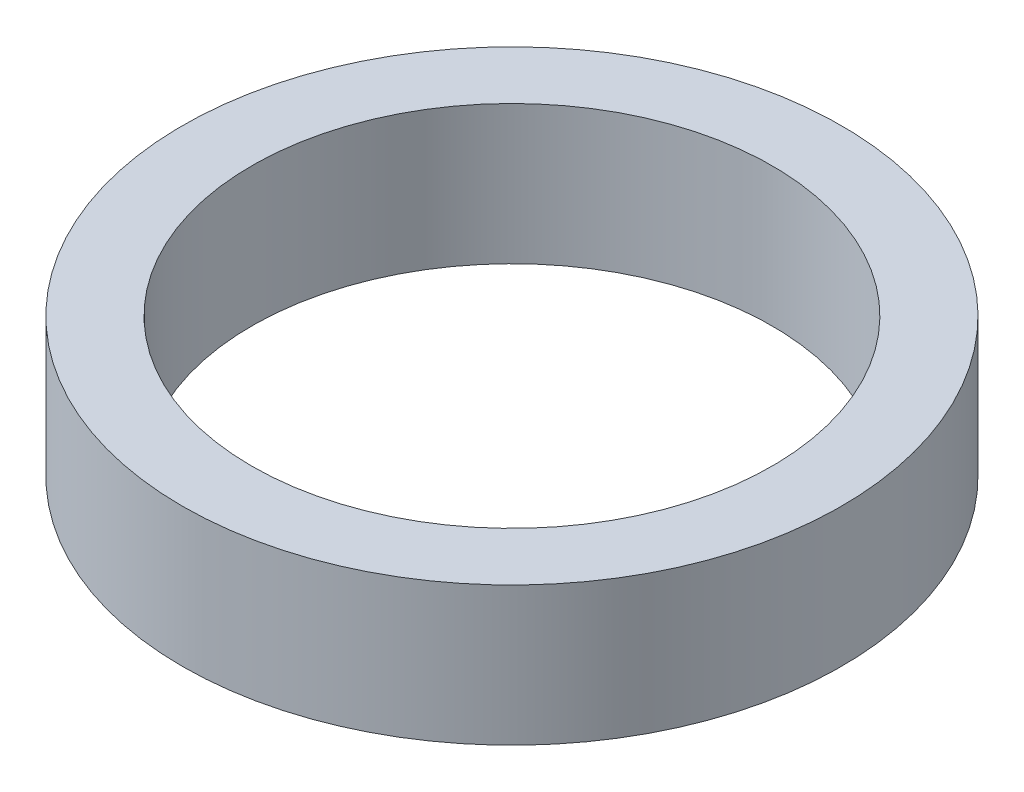
ISO-10303-21;
HEADER;
FILE_DESCRIPTION(('STEP AP214'),'2;1');
FILE_NAME('part.step','',(''),(''),'','','');
FILE_SCHEMA(('AUTOMOTIVE_DESIGN { 1 0 10303 214 1 1 1 1 }'));
ENDSEC;
DATA;
#1=APPLICATION_CONTEXT('core data for automotive mechanical design processes');
#2=APPLICATION_PROTOCOL_DEFINITION('international standard','automotive_design',2000,#1);
#3=PRODUCT_CONTEXT('',#1,'mechanical');
#4=PRODUCT('Part','Part','',(#3));
#5=PRODUCT_RELATED_PRODUCT_CATEGORY('part','',(#4));
#6=PRODUCT_DEFINITION_FORMATION('','',#4);
#7=PRODUCT_DEFINITION_CONTEXT('part definition',#1,'design');
#8=PRODUCT_DEFINITION('design','',#6,#7);
#9=PRODUCT_DEFINITION_SHAPE('','',#8);
#10=(LENGTH_UNIT() NAMED_UNIT(*) SI_UNIT(.MILLI.,.METRE.));
#11=(NAMED_UNIT(*) PLANE_ANGLE_UNIT() SI_UNIT($,.RADIAN.));
#12=(NAMED_UNIT(*) SI_UNIT($,.STERADIAN.) SOLID_ANGLE_UNIT());
#13=UNCERTAINTY_MEASURE_WITH_UNIT(LENGTH_MEASURE(1.E-05),#10,'distance_accuracy_value','');
#14=(GEOMETRIC_REPRESENTATION_CONTEXT(3) GLOBAL_UNCERTAINTY_ASSIGNED_CONTEXT((#13)) GLOBAL_UNIT_ASSIGNED_CONTEXT((#10,
#11,#12)) REPRESENTATION_CONTEXT('',''));
#15=CARTESIAN_POINT('',(0.,0.,0.));
#16=DIRECTION('',(0.,0.,1.));
#17=DIRECTION('',(1.,0.,0.));
#18=AXIS2_PLACEMENT_3D('',#15,#16,#17);
#19=CARTESIAN_POINT('',(0.,20.,0.));
#20=DIRECTION('',(0.,-1.,0.));
#21=DIRECTION('',(0.,0.,-1.));
#22=AXIS2_PLACEMENT_3D('',#19,#20,#21);
#23=CYLINDRICAL_SURFACE('',#22,47.5);
#24=CARTESIAN_POINT('',(0.,20.,0.));
#25=DIRECTION('',(0.,1.,0.));
#26=DIRECTION('',(0.,0.,1.));
#27=AXIS2_PLACEMENT_3D('',#24,#25,#26);
#28=CIRCLE('',#27,47.5);
#29=CARTESIAN_POINT('',(0.,20.,47.5));
#30=VERTEX_POINT('',#29);
#31=EDGE_CURVE('E10',#30,#30,#28,.T.);
#32=ORIENTED_EDGE('',*,*,#31,.F.);
#33=EDGE_LOOP('',(#32));
#34=FACE_BOUND('',#33,.T.);
#35=CARTESIAN_POINT('',(0.,0.,0.));
#36=DIRECTION('',(0.,1.,0.));
#37=DIRECTION('',(0.,0.,1.));
#38=AXIS2_PLACEMENT_3D('',#35,#36,#37);
#39=CIRCLE('',#38,47.5);
#40=CARTESIAN_POINT('',(0.,0.,47.5));
#41=VERTEX_POINT('',#40);
#42=EDGE_CURVE('E37',#41,#41,#39,.T.);
#43=ORIENTED_EDGE('',*,*,#42,.T.);
#44=EDGE_LOOP('',(#43));
#45=FACE_BOUND('',#44,.T.);
#46=ADVANCED_FACE('F40',(#34,#45),#23,.T.);
#47=CARTESIAN_POINT('',(0.,20.,0.));
#48=DIRECTION('',(0.,1.,0.));
#49=DIRECTION('',(0.,0.,1.));
#50=AXIS2_PLACEMENT_3D('',#47,#48,#49);
#51=PLANE('',#50);
#52=CARTESIAN_POINT('',(0.,20.,0.));
#53=DIRECTION('',(0.,1.,0.));
#54=DIRECTION('',(0.,0.,1.));
#55=AXIS2_PLACEMENT_3D('',#52,#53,#54);
#56=CIRCLE('',#55,37.5);
#57=CARTESIAN_POINT('',(0.,20.,37.5));
#58=VERTEX_POINT('',#57);
#59=EDGE_CURVE('E50',#58,#58,#56,.T.);
#60=ORIENTED_EDGE('',*,*,#59,.F.);
#61=EDGE_LOOP('',(#60));
#62=FACE_BOUND('',#61,.T.);
#63=ORIENTED_EDGE('',*,*,#31,.T.);
#64=EDGE_LOOP('',(#63));
#65=FACE_BOUND('',#64,.T.);
#66=ADVANCED_FACE('F59',(#62,#65),#51,.T.);
#67=CARTESIAN_POINT('',(0.,0.,0.));
#68=DIRECTION('',(0.,1.,0.));
#69=DIRECTION('',(0.,0.,1.));
#70=AXIS2_PLACEMENT_3D('',#67,#68,#69);
#71=PLANE('',#70);
#72=CARTESIAN_POINT('',(0.,0.,0.));
#73=DIRECTION('',(0.,1.,0.));
#74=DIRECTION('',(0.,0.,1.));
#75=AXIS2_PLACEMENT_3D('',#72,#73,#74);
#76=CIRCLE('',#75,37.5);
#77=CARTESIAN_POINT('',(0.,0.,37.5));
#78=VERTEX_POINT('',#77);
#79=EDGE_CURVE('E47',#78,#78,#76,.T.);
#80=ORIENTED_EDGE('',*,*,#79,.T.);
#81=EDGE_LOOP('',(#80));
#82=FACE_BOUND('',#81,.T.);
#83=ORIENTED_EDGE('',*,*,#42,.F.);
#84=EDGE_LOOP('',(#83));
#85=FACE_BOUND('',#84,.T.);
#86=ADVANCED_FACE('F58',(#82,#85),#71,.F.);
#87=CARTESIAN_POINT('',(0.,20.,0.));
#88=DIRECTION('',(0.,-1.,0.));
#89=DIRECTION('',(0.,0.,-1.));
#90=AXIS2_PLACEMENT_3D('',#87,#88,#89);
#91=CYLINDRICAL_SURFACE('',#90,37.5);
#92=ORIENTED_EDGE('',*,*,#59,.T.);
#93=EDGE_LOOP('',(#92));
#94=FACE_BOUND('',#93,.T.);
#95=ORIENTED_EDGE('',*,*,#79,.F.);
#96=EDGE_LOOP('',(#95));
#97=FACE_BOUND('',#96,.T.);
#98=ADVANCED_FACE('F54',(#94,#97),#91,.F.);
#99=CLOSED_SHELL('',(#46,#66,#86,#98));
#100=MANIFOLD_SOLID_BREP('B2',#99);
#101=ADVANCED_BREP_SHAPE_REPRESENTATION('',(#18,#100),#14);
#102=SHAPE_DEFINITION_REPRESENTATION(#9,#101);
ENDSEC;
END-ISO-10303-21;
